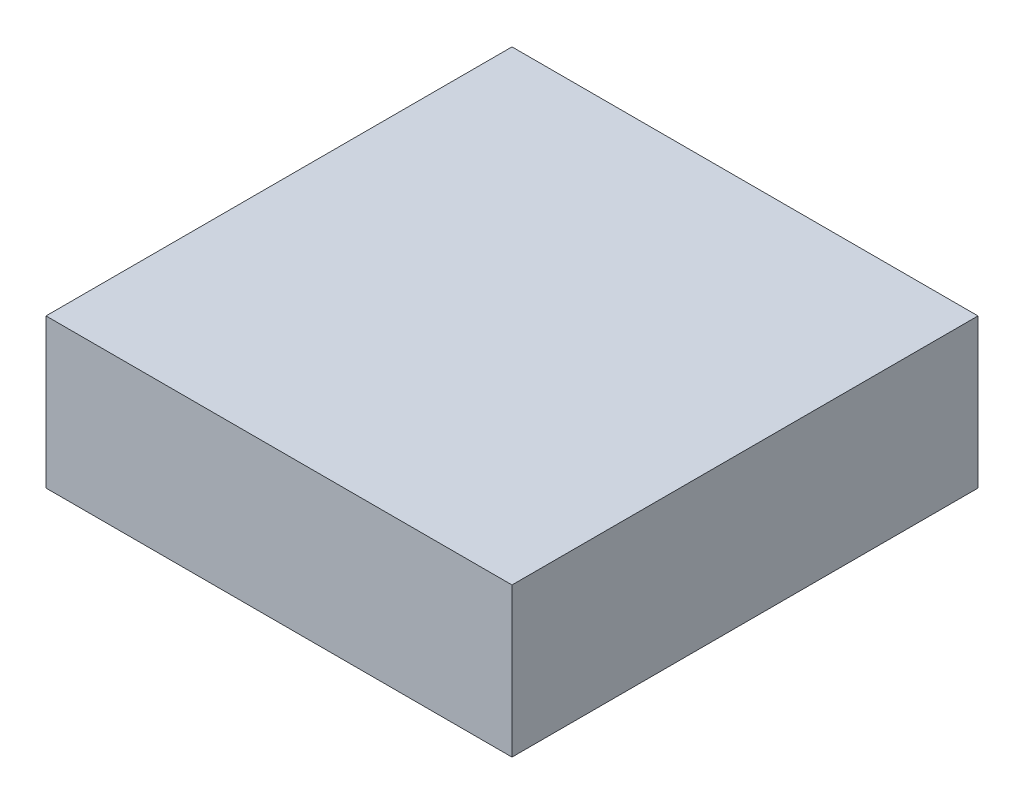
ISO-10303-21;
HEADER;
FILE_DESCRIPTION(('STEP AP214'),'2;1');
FILE_NAME('part.step','',(''),(''),'','','');
FILE_SCHEMA(('AUTOMOTIVE_DESIGN { 1 0 10303 214 1 1 1 1 }'));
ENDSEC;
DATA;
#1=APPLICATION_CONTEXT('core data for automotive mechanical design processes');
#2=APPLICATION_PROTOCOL_DEFINITION('international standard','automotive_design',2000,#1);
#3=PRODUCT_CONTEXT('',#1,'mechanical');
#4=PRODUCT('Part','Part','',(#3));
#5=PRODUCT_RELATED_PRODUCT_CATEGORY('part','',(#4));
#6=PRODUCT_DEFINITION_FORMATION('','',#4);
#7=PRODUCT_DEFINITION_CONTEXT('part definition',#1,'design');
#8=PRODUCT_DEFINITION('design','',#6,#7);
#9=PRODUCT_DEFINITION_SHAPE('','',#8);
#10=(LENGTH_UNIT() NAMED_UNIT(*) SI_UNIT(.MILLI.,.METRE.));
#11=(NAMED_UNIT(*) PLANE_ANGLE_UNIT() SI_UNIT($,.RADIAN.));
#12=(NAMED_UNIT(*) SI_UNIT($,.STERADIAN.) SOLID_ANGLE_UNIT());
#13=UNCERTAINTY_MEASURE_WITH_UNIT(LENGTH_MEASURE(1.E-05),#10,'distance_accuracy_value','');
#14=(GEOMETRIC_REPRESENTATION_CONTEXT(3) GLOBAL_UNCERTAINTY_ASSIGNED_CONTEXT((#13)) GLOBAL_UNIT_ASSIGNED_CONTEXT((#10,
#11,#12)) REPRESENTATION_CONTEXT('',''));
#15=CARTESIAN_POINT('',(0.,0.,0.));
#16=DIRECTION('',(0.,0.,1.));
#17=DIRECTION('',(1.,0.,0.));
#18=AXIS2_PLACEMENT_3D('',#15,#16,#17);
#19=CARTESIAN_POINT('',(1.25,0.8,-1.25));
#20=DIRECTION('',(-1.,0.,0.));
#21=DIRECTION('',(0.,0.,1.));
#22=AXIS2_PLACEMENT_3D('',#19,#20,#21);
#23=PLANE('',#22);
#24=DIRECTION('',(0.,0.,-1.));
#25=VECTOR('',#24,1.);
#26=CARTESIAN_POINT('',(1.25,0.,-1.25));
#27=LINE('',#26,#25);
#28=CARTESIAN_POINT('',(1.25,0.,1.25));
#29=VERTEX_POINT('',#28);
#30=CARTESIAN_POINT('',(1.25,0.,-1.25));
#31=VERTEX_POINT('',#30);
#32=EDGE_CURVE('E99',#29,#31,#27,.T.);
#33=ORIENTED_EDGE('',*,*,#32,.T.);
#34=DIRECTION('',(0.,-1.,0.));
#35=VECTOR('',#34,1.);
#36=CARTESIAN_POINT('',(1.25,0.8,-1.25));
#37=LINE('',#36,#35);
#38=CARTESIAN_POINT('',(1.25,0.8,-1.25));
#39=VERTEX_POINT('',#38);
#40=EDGE_CURVE('E11',#39,#31,#37,.T.);
#41=ORIENTED_EDGE('',*,*,#40,.F.);
#42=DIRECTION('',(0.,0.,-1.));
#43=VECTOR('',#42,1.);
#44=CARTESIAN_POINT('',(1.25,0.8,-1.25));
#45=LINE('',#44,#43);
#46=CARTESIAN_POINT('',(1.25,0.8,1.25));
#47=VERTEX_POINT('',#46);
#48=EDGE_CURVE('E87',#47,#39,#45,.T.);
#49=ORIENTED_EDGE('',*,*,#48,.F.);
#50=DIRECTION('',(0.,-1.,0.));
#51=VECTOR('',#50,1.);
#52=CARTESIAN_POINT('',(1.25,0.8,1.25));
#53=LINE('',#52,#51);
#54=EDGE_CURVE('E95',#47,#29,#53,.T.);
#55=ORIENTED_EDGE('',*,*,#54,.T.);
#56=EDGE_LOOP('',(#33,#41,#49,#55));
#57=FACE_BOUND('',#56,.T.);
#58=ADVANCED_FACE('F36',(#57),#23,.F.);
#59=CARTESIAN_POINT('',(-1.25,0.8,-1.25));
#60=DIRECTION('',(0.,0.,1.));
#61=DIRECTION('',(1.,0.,0.));
#62=AXIS2_PLACEMENT_3D('',#59,#60,#61);
#63=PLANE('',#62);
#64=DIRECTION('',(-1.,0.,0.));
#65=VECTOR('',#64,1.);
#66=CARTESIAN_POINT('',(-1.25,0.,-1.25));
#67=LINE('',#66,#65);
#68=CARTESIAN_POINT('',(-1.25,0.,-1.25));
#69=VERTEX_POINT('',#68);
#70=EDGE_CURVE('E91',#31,#69,#67,.T.);
#71=ORIENTED_EDGE('',*,*,#70,.T.);
#72=DIRECTION('',(0.,-1.,0.));
#73=VECTOR('',#72,1.);
#74=CARTESIAN_POINT('',(-1.25,0.8,-1.25));
#75=LINE('',#74,#73);
#76=CARTESIAN_POINT('',(-1.25,0.8,-1.25));
#77=VERTEX_POINT('',#76);
#78=EDGE_CURVE('E44',#77,#69,#75,.T.);
#79=ORIENTED_EDGE('',*,*,#78,.F.);
#80=DIRECTION('',(-1.,0.,0.));
#81=VECTOR('',#80,1.);
#82=CARTESIAN_POINT('',(-1.25,0.8,-1.25));
#83=LINE('',#82,#81);
#84=EDGE_CURVE('E82',#39,#77,#83,.T.);
#85=ORIENTED_EDGE('',*,*,#84,.F.);
#86=ORIENTED_EDGE('',*,*,#40,.T.);
#87=EDGE_LOOP('',(#71,#79,#85,#86));
#88=FACE_BOUND('',#87,.T.);
#89=ADVANCED_FACE('F90',(#88),#63,.F.);
#90=CARTESIAN_POINT('',(-1.25,0.8,-1.25));
#91=DIRECTION('',(1.,0.,0.));
#92=DIRECTION('',(0.,0.,-1.));
#93=AXIS2_PLACEMENT_3D('',#90,#91,#92);
#94=PLANE('',#93);
#95=DIRECTION('',(0.,0.,1.));
#96=VECTOR('',#95,1.);
#97=CARTESIAN_POINT('',(-1.25,0.,-1.25));
#98=LINE('',#97,#96);
#99=CARTESIAN_POINT('',(-1.25,0.,1.25));
#100=VERTEX_POINT('',#99);
#101=EDGE_CURVE('E69',#69,#100,#98,.T.);
#102=ORIENTED_EDGE('',*,*,#101,.T.);
#103=DIRECTION('',(0.,-1.,0.));
#104=VECTOR('',#103,1.);
#105=CARTESIAN_POINT('',(-1.25,0.8,1.25));
#106=LINE('',#105,#104);
#107=CARTESIAN_POINT('',(-1.25,0.8,1.25));
#108=VERTEX_POINT('',#107);
#109=EDGE_CURVE('E92',#108,#100,#106,.T.);
#110=ORIENTED_EDGE('',*,*,#109,.F.);
#111=DIRECTION('',(0.,0.,1.));
#112=VECTOR('',#111,1.);
#113=CARTESIAN_POINT('',(-1.25,0.8,-1.25));
#114=LINE('',#113,#112);
#115=EDGE_CURVE('E85',#77,#108,#114,.T.);
#116=ORIENTED_EDGE('',*,*,#115,.F.);
#117=ORIENTED_EDGE('',*,*,#78,.T.);
#118=EDGE_LOOP('',(#102,#110,#116,#117));
#119=FACE_BOUND('',#118,.T.);
#120=ADVANCED_FACE('F93',(#119),#94,.F.);
#121=CARTESIAN_POINT('',(-1.25,0.8,1.25));
#122=DIRECTION('',(0.,0.,-1.));
#123=DIRECTION('',(-1.,0.,0.));
#124=AXIS2_PLACEMENT_3D('',#121,#122,#123);
#125=PLANE('',#124);
#126=DIRECTION('',(1.,0.,0.));
#127=VECTOR('',#126,1.);
#128=CARTESIAN_POINT('',(-1.25,0.,1.25));
#129=LINE('',#128,#127);
#130=EDGE_CURVE('E75',#100,#29,#129,.T.);
#131=ORIENTED_EDGE('',*,*,#130,.T.);
#132=ORIENTED_EDGE('',*,*,#54,.F.);
#133=DIRECTION('',(1.,0.,0.));
#134=VECTOR('',#133,1.);
#135=CARTESIAN_POINT('',(-1.25,0.8,1.25));
#136=LINE('',#135,#134);
#137=EDGE_CURVE('E52',#108,#47,#136,.T.);
#138=ORIENTED_EDGE('',*,*,#137,.F.);
#139=ORIENTED_EDGE('',*,*,#109,.T.);
#140=EDGE_LOOP('',(#131,#132,#138,#139));
#141=FACE_BOUND('',#140,.T.);
#142=ADVANCED_FACE('F106',(#141),#125,.F.);
#143=CARTESIAN_POINT('',(0.,0.8,0.));
#144=DIRECTION('',(0.,1.,0.));
#145=DIRECTION('',(0.,0.,1.));
#146=AXIS2_PLACEMENT_3D('',#143,#144,#145);
#147=PLANE('',#146);
#148=ORIENTED_EDGE('',*,*,#48,.T.);
#149=ORIENTED_EDGE('',*,*,#84,.T.);
#150=ORIENTED_EDGE('',*,*,#115,.T.);
#151=ORIENTED_EDGE('',*,*,#137,.T.);
#152=EDGE_LOOP('',(#148,#149,#150,#151));
#153=FACE_BOUND('',#152,.T.);
#154=ADVANCED_FACE('F83',(#153),#147,.T.);
#155=CARTESIAN_POINT('',(0.,0.,0.));
#156=DIRECTION('',(0.,1.,0.));
#157=DIRECTION('',(0.,0.,1.));
#158=AXIS2_PLACEMENT_3D('',#155,#156,#157);
#159=PLANE('',#158);
#160=ORIENTED_EDGE('',*,*,#32,.F.);
#161=ORIENTED_EDGE('',*,*,#130,.F.);
#162=ORIENTED_EDGE('',*,*,#101,.F.);
#163=ORIENTED_EDGE('',*,*,#70,.F.);
#164=EDGE_LOOP('',(#160,#161,#162,#163));
#165=FACE_BOUND('',#164,.T.);
#166=ADVANCED_FACE('F109',(#165),#159,.F.);
#167=CLOSED_SHELL('',(#58,#89,#120,#142,#154,#166));
#168=MANIFOLD_SOLID_BREP('B2',#167);
#169=ADVANCED_BREP_SHAPE_REPRESENTATION('',(#18,#168),#14);
#170=SHAPE_DEFINITION_REPRESENTATION(#9,#169);
ENDSEC;
END-ISO-10303-21;
